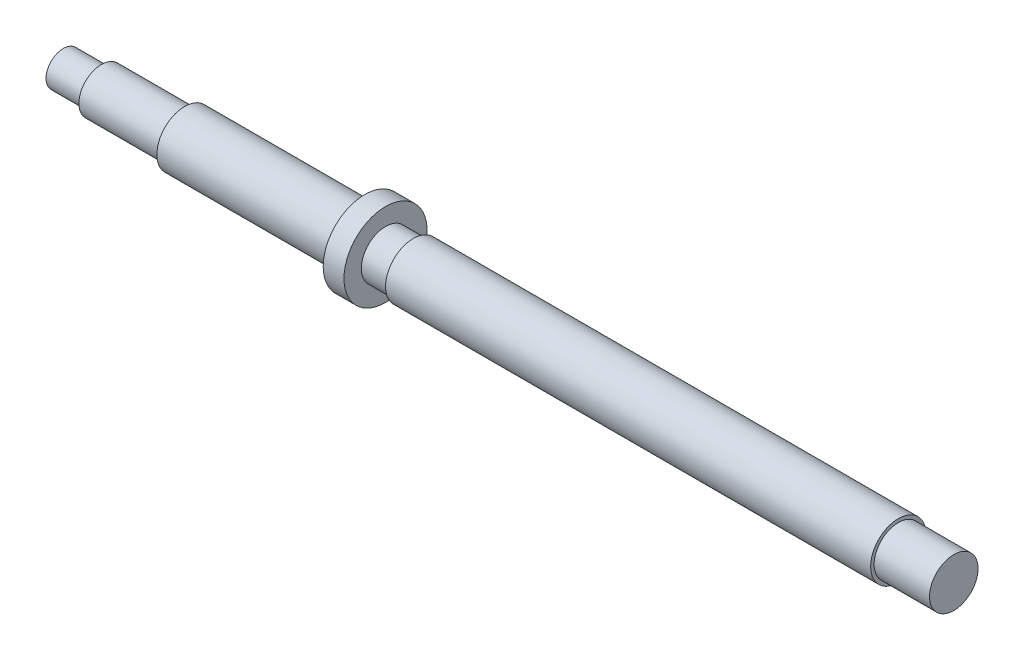
ISO-10303-21;
HEADER;
FILE_DESCRIPTION(('STEP AP214'),'2;1');
FILE_NAME('part.step','',(''),(''),'','','');
FILE_SCHEMA(('AUTOMOTIVE_DESIGN { 1 0 10303 214 1 1 1 1 }'));
ENDSEC;
DATA;
#1=APPLICATION_CONTEXT('core data for automotive mechanical design processes');
#2=APPLICATION_PROTOCOL_DEFINITION('international standard','automotive_design',2000,#1);
#3=PRODUCT_CONTEXT('',#1,'mechanical');
#4=PRODUCT('Part','Part','',(#3));
#5=PRODUCT_RELATED_PRODUCT_CATEGORY('part','',(#4));
#6=PRODUCT_DEFINITION_FORMATION('','',#4);
#7=PRODUCT_DEFINITION_CONTEXT('part definition',#1,'design');
#8=PRODUCT_DEFINITION('design','',#6,#7);
#9=PRODUCT_DEFINITION_SHAPE('','',#8);
#10=(LENGTH_UNIT() NAMED_UNIT(*) SI_UNIT(.MILLI.,.METRE.));
#11=(NAMED_UNIT(*) PLANE_ANGLE_UNIT() SI_UNIT($,.RADIAN.));
#12=(NAMED_UNIT(*) SI_UNIT($,.STERADIAN.) SOLID_ANGLE_UNIT());
#13=UNCERTAINTY_MEASURE_WITH_UNIT(LENGTH_MEASURE(1.E-05),#10,'distance_accuracy_value','');
#14=(GEOMETRIC_REPRESENTATION_CONTEXT(3) GLOBAL_UNCERTAINTY_ASSIGNED_CONTEXT((#13)) GLOBAL_UNIT_ASSIGNED_CONTEXT((#10,
#11,#12)) REPRESENTATION_CONTEXT('',''));
#15=CARTESIAN_POINT('',(0.,0.,0.));
#16=DIRECTION('',(0.,0.,1.));
#17=DIRECTION('',(1.,0.,0.));
#18=AXIS2_PLACEMENT_3D('',#15,#16,#17);
#19=CARTESIAN_POINT('',(0.,0.,0.));
#20=DIRECTION('',(-1.,0.,0.));
#21=DIRECTION('',(0.,0.,1.));
#22=AXIS2_PLACEMENT_3D('',#19,#20,#21);
#23=PLANE('',#22);
#24=CARTESIAN_POINT('',(0.,0.,-5.));
#25=DIRECTION('',(-1.,0.,0.));
#26=DIRECTION('',(0.,0.,1.));
#27=AXIS2_PLACEMENT_3D('',#24,#25,#26);
#28=CIRCLE('',#27,5.);
#29=CARTESIAN_POINT('',(0.,0.,0.));
#30=VERTEX_POINT('',#29);
#31=EDGE_CURVE('E81',#30,#30,#28,.T.);
#32=ORIENTED_EDGE('',*,*,#31,.T.);
#33=EDGE_LOOP('',(#32));
#34=FACE_BOUND('',#33,.T.);
#35=ADVANCED_FACE('F35',(#34),#23,.T.);
#36=CARTESIAN_POINT('',(257.,0.,2.));
#37=DIRECTION('',(1.,0.,0.));
#38=DIRECTION('',(0.,0.,-1.));
#39=AXIS2_PLACEMENT_3D('',#36,#37,#38);
#40=PLANE('',#39);
#41=CARTESIAN_POINT('',(257.,0.,-5.));
#42=DIRECTION('',(-1.,0.,0.));
#43=DIRECTION('',(0.,0.,1.));
#44=AXIS2_PLACEMENT_3D('',#41,#42,#43);
#45=CIRCLE('',#44,7.);
#46=CARTESIAN_POINT('',(257.,0.,2.));
#47=VERTEX_POINT('',#46);
#48=EDGE_CURVE('E10',#47,#47,#45,.T.);
#49=ORIENTED_EDGE('',*,*,#48,.F.);
#50=EDGE_LOOP('',(#49));
#51=FACE_BOUND('',#50,.T.);
#52=ADVANCED_FACE('F98',(#51),#40,.T.);
#53=CARTESIAN_POINT('',(0.,0.,-5.));
#54=DIRECTION('',(-1.,0.,0.));
#55=DIRECTION('',(0.,0.,1.));
#56=AXIS2_PLACEMENT_3D('',#53,#54,#55);
#57=CYLINDRICAL_SURFACE('',#56,7.);
#58=ORIENTED_EDGE('',*,*,#48,.T.);
#59=EDGE_LOOP('',(#58));
#60=FACE_BOUND('',#59,.T.);
#61=CARTESIAN_POINT('',(241.,0.,-5.));
#62=DIRECTION('',(-1.,0.,0.));
#63=DIRECTION('',(0.,0.,1.));
#64=AXIS2_PLACEMENT_3D('',#61,#62,#63);
#65=CIRCLE('',#64,7.);
#66=CARTESIAN_POINT('',(241.,0.,2.));
#67=VERTEX_POINT('',#66);
#68=EDGE_CURVE('E41',#67,#67,#65,.T.);
#69=ORIENTED_EDGE('',*,*,#68,.F.);
#70=EDGE_LOOP('',(#69));
#71=FACE_BOUND('',#70,.T.);
#72=ADVANCED_FACE('F102',(#60,#71),#57,.T.);
#73=CARTESIAN_POINT('',(241.,0.,3.));
#74=DIRECTION('',(1.,0.,0.));
#75=DIRECTION('',(0.,0.,-1.));
#76=AXIS2_PLACEMENT_3D('',#73,#74,#75);
#77=PLANE('',#76);
#78=ORIENTED_EDGE('',*,*,#68,.T.);
#79=EDGE_LOOP('',(#78));
#80=FACE_BOUND('',#79,.T.);
#81=CARTESIAN_POINT('',(241.,0.,-5.));
#82=DIRECTION('',(-1.,0.,0.));
#83=DIRECTION('',(0.,0.,1.));
#84=AXIS2_PLACEMENT_3D('',#81,#82,#83);
#85=CIRCLE('',#84,8.);
#86=CARTESIAN_POINT('',(241.,0.,3.));
#87=VERTEX_POINT('',#86);
#88=EDGE_CURVE('E45',#87,#87,#85,.T.);
#89=ORIENTED_EDGE('',*,*,#88,.F.);
#90=EDGE_LOOP('',(#89));
#91=FACE_BOUND('',#90,.T.);
#92=ADVANCED_FACE('F107',(#80,#91),#77,.T.);
#93=CARTESIAN_POINT('',(0.,0.,-5.));
#94=DIRECTION('',(-1.,0.,0.));
#95=DIRECTION('',(0.,0.,1.));
#96=AXIS2_PLACEMENT_3D('',#93,#94,#95);
#97=CYLINDRICAL_SURFACE('',#96,8.);
#98=ORIENTED_EDGE('',*,*,#88,.T.);
#99=EDGE_LOOP('',(#98));
#100=FACE_BOUND('',#99,.T.);
#101=CARTESIAN_POINT('',(101.,0.,-5.));
#102=DIRECTION('',(-1.,0.,0.));
#103=DIRECTION('',(0.,0.,1.));
#104=AXIS2_PLACEMENT_3D('',#101,#102,#103);
#105=CIRCLE('',#104,8.);
#106=CARTESIAN_POINT('',(101.,0.,3.));
#107=VERTEX_POINT('',#106);
#108=EDGE_CURVE('E49',#107,#107,#105,.T.);
#109=ORIENTED_EDGE('',*,*,#108,.F.);
#110=EDGE_LOOP('',(#109));
#111=FACE_BOUND('',#110,.T.);
#112=ADVANCED_FACE('F112',(#100,#111),#97,.T.);
#113=CARTESIAN_POINT('',(101.,0.,2.));
#114=DIRECTION('',(-1.,0.,0.));
#115=DIRECTION('',(0.,0.,1.));
#116=AXIS2_PLACEMENT_3D('',#113,#114,#115);
#117=PLANE('',#116);
#118=ORIENTED_EDGE('',*,*,#108,.T.);
#119=EDGE_LOOP('',(#118));
#120=FACE_BOUND('',#119,.T.);
#121=CARTESIAN_POINT('',(101.,0.,-5.));
#122=DIRECTION('',(-1.,0.,0.));
#123=DIRECTION('',(0.,0.,1.));
#124=AXIS2_PLACEMENT_3D('',#121,#122,#123);
#125=CIRCLE('',#124,7.);
#126=CARTESIAN_POINT('',(101.,0.,2.));
#127=VERTEX_POINT('',#126);
#128=EDGE_CURVE('E54',#127,#127,#125,.T.);
#129=ORIENTED_EDGE('',*,*,#128,.F.);
#130=EDGE_LOOP('',(#129));
#131=FACE_BOUND('',#130,.T.);
#132=ADVANCED_FACE('F115',(#120,#131),#117,.T.);
#133=CARTESIAN_POINT('',(0.,0.,-5.));
#134=DIRECTION('',(-1.,0.,0.));
#135=DIRECTION('',(0.,0.,1.));
#136=AXIS2_PLACEMENT_3D('',#133,#134,#135);
#137=CYLINDRICAL_SURFACE('',#136,7.);
#138=ORIENTED_EDGE('',*,*,#128,.T.);
#139=EDGE_LOOP('',(#138));
#140=FACE_BOUND('',#139,.T.);
#141=CARTESIAN_POINT('',(93.,0.,-5.));
#142=DIRECTION('',(-1.,0.,0.));
#143=DIRECTION('',(0.,0.,1.));
#144=AXIS2_PLACEMENT_3D('',#141,#142,#143);
#145=CIRCLE('',#144,7.);
#146=CARTESIAN_POINT('',(93.,0.,2.));
#147=VERTEX_POINT('',#146);
#148=EDGE_CURVE('E57',#147,#147,#145,.T.);
#149=ORIENTED_EDGE('',*,*,#148,.F.);
#150=EDGE_LOOP('',(#149));
#151=FACE_BOUND('',#150,.T.);
#152=ADVANCED_FACE('F119',(#140,#151),#137,.T.);
#153=CARTESIAN_POINT('',(93.,0.,7.));
#154=DIRECTION('',(1.,0.,0.));
#155=DIRECTION('',(0.,0.,-1.));
#156=AXIS2_PLACEMENT_3D('',#153,#154,#155);
#157=PLANE('',#156);
#158=ORIENTED_EDGE('',*,*,#148,.T.);
#159=EDGE_LOOP('',(#158));
#160=FACE_BOUND('',#159,.T.);
#161=CARTESIAN_POINT('',(93.,0.,-5.));
#162=DIRECTION('',(-1.,0.,0.));
#163=DIRECTION('',(0.,0.,1.));
#164=AXIS2_PLACEMENT_3D('',#161,#162,#163);
#165=CIRCLE('',#164,12.);
#166=CARTESIAN_POINT('',(93.,0.,7.));
#167=VERTEX_POINT('',#166);
#168=EDGE_CURVE('E60',#167,#167,#165,.T.);
#169=ORIENTED_EDGE('',*,*,#168,.F.);
#170=EDGE_LOOP('',(#169));
#171=FACE_BOUND('',#170,.T.);
#172=ADVANCED_FACE('F123',(#160,#171),#157,.T.);
#173=CARTESIAN_POINT('',(0.,0.,-5.));
#174=DIRECTION('',(-1.,0.,0.));
#175=DIRECTION('',(0.,0.,1.));
#176=AXIS2_PLACEMENT_3D('',#173,#174,#175);
#177=CYLINDRICAL_SURFACE('',#176,12.);
#178=ORIENTED_EDGE('',*,*,#168,.T.);
#179=EDGE_LOOP('',(#178));
#180=FACE_BOUND('',#179,.T.);
#181=CARTESIAN_POINT('',(87.,0.,-5.));
#182=DIRECTION('',(-1.,0.,0.));
#183=DIRECTION('',(0.,0.,1.));
#184=AXIS2_PLACEMENT_3D('',#181,#182,#183);
#185=CIRCLE('',#184,12.);
#186=CARTESIAN_POINT('',(87.,0.,7.));
#187=VERTEX_POINT('',#186);
#188=EDGE_CURVE('E63',#187,#187,#185,.T.);
#189=ORIENTED_EDGE('',*,*,#188,.F.);
#190=EDGE_LOOP('',(#189));
#191=FACE_BOUND('',#190,.T.);
#192=ADVANCED_FACE('F127',(#180,#191),#177,.T.);
#193=CARTESIAN_POINT('',(87.,0.,3.));
#194=DIRECTION('',(-1.,0.,0.));
#195=DIRECTION('',(0.,0.,1.));
#196=AXIS2_PLACEMENT_3D('',#193,#194,#195);
#197=PLANE('',#196);
#198=ORIENTED_EDGE('',*,*,#188,.T.);
#199=EDGE_LOOP('',(#198));
#200=FACE_BOUND('',#199,.T.);
#201=CARTESIAN_POINT('',(87.,0.,-5.));
#202=DIRECTION('',(-1.,0.,0.));
#203=DIRECTION('',(0.,0.,1.));
#204=AXIS2_PLACEMENT_3D('',#201,#202,#203);
#205=CIRCLE('',#204,8.);
#206=CARTESIAN_POINT('',(87.,0.,3.));
#207=VERTEX_POINT('',#206);
#208=EDGE_CURVE('E66',#207,#207,#205,.T.);
#209=ORIENTED_EDGE('',*,*,#208,.F.);
#210=EDGE_LOOP('',(#209));
#211=FACE_BOUND('',#210,.T.);
#212=ADVANCED_FACE('F131',(#200,#211),#197,.T.);
#213=CARTESIAN_POINT('',(0.,0.,-5.));
#214=DIRECTION('',(-1.,0.,0.));
#215=DIRECTION('',(0.,0.,1.));
#216=AXIS2_PLACEMENT_3D('',#213,#214,#215);
#217=CYLINDRICAL_SURFACE('',#216,8.);
#218=ORIENTED_EDGE('',*,*,#208,.T.);
#219=EDGE_LOOP('',(#218));
#220=FACE_BOUND('',#219,.T.);
#221=CARTESIAN_POINT('',(35.,0.,-5.));
#222=DIRECTION('',(-1.,0.,0.));
#223=DIRECTION('',(0.,0.,1.));
#224=AXIS2_PLACEMENT_3D('',#221,#222,#223);
#225=CIRCLE('',#224,8.);
#226=CARTESIAN_POINT('',(35.,0.,3.));
#227=VERTEX_POINT('',#226);
#228=EDGE_CURVE('E69',#227,#227,#225,.T.);
#229=ORIENTED_EDGE('',*,*,#228,.F.);
#230=EDGE_LOOP('',(#229));
#231=FACE_BOUND('',#230,.T.);
#232=ADVANCED_FACE('F135',(#220,#231),#217,.T.);
#233=CARTESIAN_POINT('',(35.,0.,1.5));
#234=DIRECTION('',(-1.,0.,0.));
#235=DIRECTION('',(0.,0.,1.));
#236=AXIS2_PLACEMENT_3D('',#233,#234,#235);
#237=PLANE('',#236);
#238=ORIENTED_EDGE('',*,*,#228,.T.);
#239=EDGE_LOOP('',(#238));
#240=FACE_BOUND('',#239,.T.);
#241=CARTESIAN_POINT('',(35.,0.,-5.));
#242=DIRECTION('',(-1.,0.,0.));
#243=DIRECTION('',(0.,0.,1.));
#244=AXIS2_PLACEMENT_3D('',#241,#242,#243);
#245=CIRCLE('',#244,6.5);
#246=CARTESIAN_POINT('',(35.,0.,1.5));
#247=VERTEX_POINT('',#246);
#248=EDGE_CURVE('E72',#247,#247,#245,.T.);
#249=ORIENTED_EDGE('',*,*,#248,.F.);
#250=EDGE_LOOP('',(#249));
#251=FACE_BOUND('',#250,.T.);
#252=ADVANCED_FACE('F139',(#240,#251),#237,.T.);
#253=CARTESIAN_POINT('',(0.,0.,-5.));
#254=DIRECTION('',(-1.,0.,0.));
#255=DIRECTION('',(0.,0.,1.));
#256=AXIS2_PLACEMENT_3D('',#253,#254,#255);
#257=CYLINDRICAL_SURFACE('',#256,6.5);
#258=ORIENTED_EDGE('',*,*,#248,.T.);
#259=EDGE_LOOP('',(#258));
#260=FACE_BOUND('',#259,.T.);
#261=CARTESIAN_POINT('',(11.,0.,-5.));
#262=DIRECTION('',(-1.,0.,0.));
#263=DIRECTION('',(0.,0.,1.));
#264=AXIS2_PLACEMENT_3D('',#261,#262,#263);
#265=CIRCLE('',#264,6.5);
#266=CARTESIAN_POINT('',(11.,0.,1.5));
#267=VERTEX_POINT('',#266);
#268=EDGE_CURVE('E75',#267,#267,#265,.T.);
#269=ORIENTED_EDGE('',*,*,#268,.F.);
#270=EDGE_LOOP('',(#269));
#271=FACE_BOUND('',#270,.T.);
#272=ADVANCED_FACE('F94',(#260,#271),#257,.T.);
#273=CARTESIAN_POINT('',(11.,0.,0.));
#274=DIRECTION('',(-1.,0.,0.));
#275=DIRECTION('',(0.,0.,1.));
#276=AXIS2_PLACEMENT_3D('',#273,#274,#275);
#277=PLANE('',#276);
#278=ORIENTED_EDGE('',*,*,#268,.T.);
#279=EDGE_LOOP('',(#278));
#280=FACE_BOUND('',#279,.T.);
#281=CARTESIAN_POINT('',(11.,0.,-5.));
#282=DIRECTION('',(-1.,0.,0.));
#283=DIRECTION('',(0.,0.,1.));
#284=AXIS2_PLACEMENT_3D('',#281,#282,#283);
#285=CIRCLE('',#284,5.);
#286=CARTESIAN_POINT('',(11.,0.,0.));
#287=VERTEX_POINT('',#286);
#288=EDGE_CURVE('E78',#287,#287,#285,.T.);
#289=ORIENTED_EDGE('',*,*,#288,.F.);
#290=EDGE_LOOP('',(#289));
#291=FACE_BOUND('',#290,.T.);
#292=ADVANCED_FACE('F88',(#280,#291),#277,.T.);
#293=CARTESIAN_POINT('',(0.,0.,-5.));
#294=DIRECTION('',(-1.,0.,0.));
#295=DIRECTION('',(0.,0.,1.));
#296=AXIS2_PLACEMENT_3D('',#293,#294,#295);
#297=CYLINDRICAL_SURFACE('',#296,5.);
#298=ORIENTED_EDGE('',*,*,#288,.T.);
#299=EDGE_LOOP('',(#298));
#300=FACE_BOUND('',#299,.T.);
#301=ORIENTED_EDGE('',*,*,#31,.F.);
#302=EDGE_LOOP('',(#301));
#303=FACE_BOUND('',#302,.T.);
#304=ADVANCED_FACE('F86',(#300,#303),#297,.T.);
#305=CLOSED_SHELL('',(#35,#52,#72,#92,#112,#132,#152,#172,#192,#212,#232,#252,#272,#292,#304));
#306=MANIFOLD_SOLID_BREP('B2',#305);
#307=ADVANCED_BREP_SHAPE_REPRESENTATION('',(#18,#306),#14);
#308=SHAPE_DEFINITION_REPRESENTATION(#9,#307);
ENDSEC;
END-ISO-10303-21;
